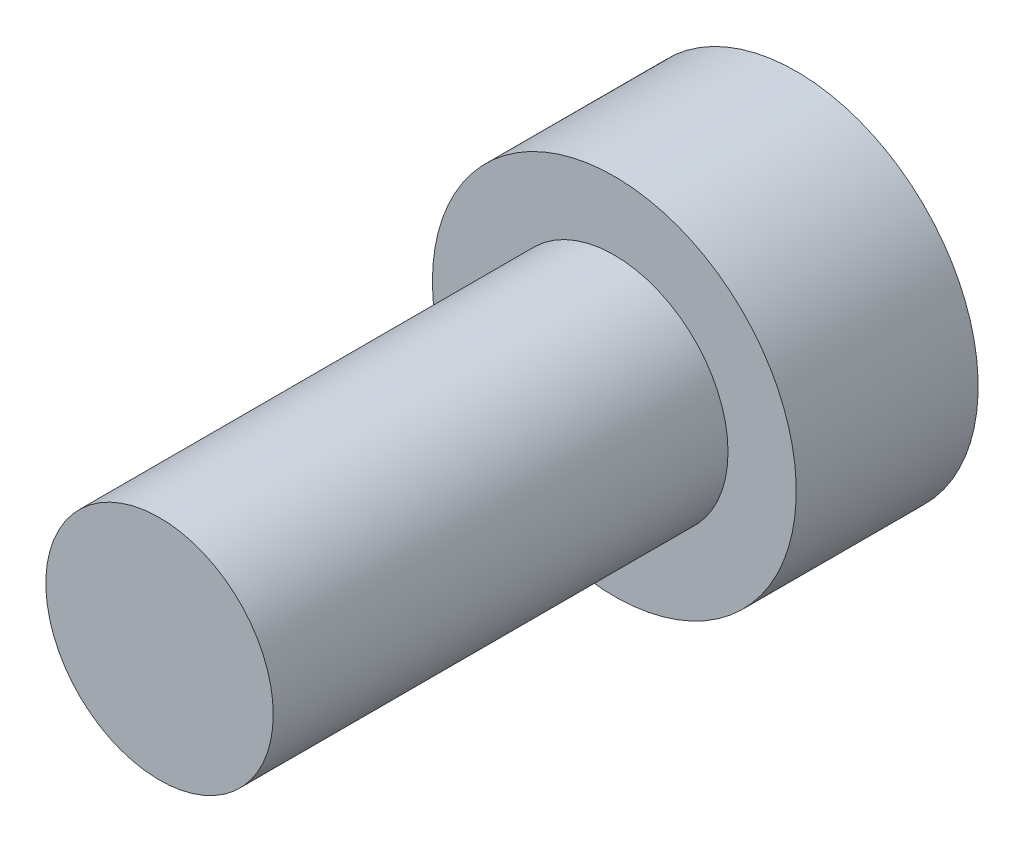
ISO-10303-21;
HEADER;
FILE_DESCRIPTION(('STEP AP214'),'2;1');
FILE_NAME('part.step','',(''),(''),'','','');
FILE_SCHEMA(('AUTOMOTIVE_DESIGN { 1 0 10303 214 1 1 1 1 }'));
ENDSEC;
DATA;
#1=APPLICATION_CONTEXT('core data for automotive mechanical design processes');
#2=APPLICATION_PROTOCOL_DEFINITION('international standard','automotive_design',2000,#1);
#3=PRODUCT_CONTEXT('',#1,'mechanical');
#4=PRODUCT('Part','Part','',(#3));
#5=PRODUCT_RELATED_PRODUCT_CATEGORY('part','',(#4));
#6=PRODUCT_DEFINITION_FORMATION('','',#4);
#7=PRODUCT_DEFINITION_CONTEXT('part definition',#1,'design');
#8=PRODUCT_DEFINITION('design','',#6,#7);
#9=PRODUCT_DEFINITION_SHAPE('','',#8);
#10=(LENGTH_UNIT() NAMED_UNIT(*) SI_UNIT(.MILLI.,.METRE.));
#11=(NAMED_UNIT(*) PLANE_ANGLE_UNIT() SI_UNIT($,.RADIAN.));
#12=(NAMED_UNIT(*) SI_UNIT($,.STERADIAN.) SOLID_ANGLE_UNIT());
#13=UNCERTAINTY_MEASURE_WITH_UNIT(LENGTH_MEASURE(1.E-05),#10,'distance_accuracy_value','');
#14=(GEOMETRIC_REPRESENTATION_CONTEXT(3) GLOBAL_UNCERTAINTY_ASSIGNED_CONTEXT((#13)) GLOBAL_UNIT_ASSIGNED_CONTEXT((#10,
#11,#12)) REPRESENTATION_CONTEXT('',''));
#15=CARTESIAN_POINT('',(0.,0.,0.));
#16=DIRECTION('',(0.,0.,1.));
#17=DIRECTION('',(1.,0.,0.));
#18=AXIS2_PLACEMENT_3D('',#15,#16,#17);
#19=CARTESIAN_POINT('',(0.,0.,10.));
#20=DIRECTION('',(0.,0.,-1.));
#21=DIRECTION('',(-1.,0.,0.));
#22=AXIS2_PLACEMENT_3D('',#19,#20,#21);
#23=CYLINDRICAL_SURFACE('',#22,2.5);
#24=CARTESIAN_POINT('',(0.,0.,10.));
#25=DIRECTION('',(0.,0.,1.));
#26=DIRECTION('',(1.,0.,0.));
#27=AXIS2_PLACEMENT_3D('',#24,#25,#26);
#28=CIRCLE('',#27,2.5);
#29=CARTESIAN_POINT('',(2.5,0.,10.));
#30=VERTEX_POINT('',#29);
#31=EDGE_CURVE('E11',#30,#30,#28,.T.);
#32=ORIENTED_EDGE('',*,*,#31,.F.);
#33=EDGE_LOOP('',(#32));
#34=FACE_BOUND('',#33,.T.);
#35=CARTESIAN_POINT('',(0.,0.,0.));
#36=DIRECTION('',(0.,0.,1.));
#37=DIRECTION('',(1.,0.,0.));
#38=AXIS2_PLACEMENT_3D('',#35,#36,#37);
#39=CIRCLE('',#38,2.5);
#40=CARTESIAN_POINT('',(2.5,0.,0.));
#41=VERTEX_POINT('',#40);
#42=EDGE_CURVE('E50',#41,#41,#39,.T.);
#43=ORIENTED_EDGE('',*,*,#42,.T.);
#44=EDGE_LOOP('',(#43));
#45=FACE_BOUND('',#44,.T.);
#46=ADVANCED_FACE('F47',(#34,#45),#23,.T.);
#47=CARTESIAN_POINT('',(0.,0.,10.));
#48=DIRECTION('',(0.,0.,1.));
#49=DIRECTION('',(1.,0.,0.));
#50=AXIS2_PLACEMENT_3D('',#47,#48,#49);
#51=PLANE('',#50);
#52=ORIENTED_EDGE('',*,*,#31,.T.);
#53=EDGE_LOOP('',(#52));
#54=FACE_BOUND('',#53,.T.);
#55=ADVANCED_FACE('F179',(#54),#51,.T.);
#56=CARTESIAN_POINT('',(0.,0.,-4.));
#57=DIRECTION('',(0.,0.,1.));
#58=DIRECTION('',(1.,0.,0.));
#59=AXIS2_PLACEMENT_3D('',#56,#57,#58);
#60=CYLINDRICAL_SURFACE('',#59,4.);
#61=CARTESIAN_POINT('',(0.,0.,-4.));
#62=DIRECTION('',(0.,0.,-1.));
#63=DIRECTION('',(-1.,0.,0.));
#64=AXIS2_PLACEMENT_3D('',#61,#62,#63);
#65=CIRCLE('',#64,4.);
#66=CARTESIAN_POINT('',(-4.,0.,-4.));
#67=VERTEX_POINT('',#66);
#68=EDGE_CURVE('E154',#67,#67,#65,.T.);
#69=ORIENTED_EDGE('',*,*,#68,.F.);
#70=EDGE_LOOP('',(#69));
#71=FACE_BOUND('',#70,.T.);
#72=CARTESIAN_POINT('',(0.,0.,0.));
#73=DIRECTION('',(0.,0.,-1.));
#74=DIRECTION('',(-1.,0.,0.));
#75=AXIS2_PLACEMENT_3D('',#72,#73,#74);
#76=CIRCLE('',#75,4.);
#77=CARTESIAN_POINT('',(-4.,0.,0.));
#78=VERTEX_POINT('',#77);
#79=EDGE_CURVE('E148',#78,#78,#76,.T.);
#80=ORIENTED_EDGE('',*,*,#79,.T.);
#81=EDGE_LOOP('',(#80));
#82=FACE_BOUND('',#81,.T.);
#83=ADVANCED_FACE('F160',(#71,#82),#60,.T.);
#84=CARTESIAN_POINT('',(0.,0.,-4.));
#85=DIRECTION('',(0.,0.,-1.));
#86=DIRECTION('',(-1.,0.,0.));
#87=AXIS2_PLACEMENT_3D('',#84,#85,#86);
#88=PLANE('',#87);
#89=DIRECTION('',(1.,0.,0.));
#90=VECTOR('',#89,1.);
#91=CARTESIAN_POINT('',(-1.73205080756888,3.,-4.));
#92=LINE('',#91,#90);
#93=CARTESIAN_POINT('',(-1.73205080756888,3.,-4.));
#94=VERTEX_POINT('',#93);
#95=CARTESIAN_POINT('',(1.73205080756888,3.,-4.));
#96=VERTEX_POINT('',#95);
#97=EDGE_CURVE('E61',#94,#96,#92,.T.);
#98=ORIENTED_EDGE('',*,*,#97,.F.);
#99=DIRECTION('',(0.5,0.866025403784439,0.));
#100=VECTOR('',#99,1.);
#101=CARTESIAN_POINT('',(-3.46410161513775,0.,-4.));
#102=LINE('',#101,#100);
#103=CARTESIAN_POINT('',(-3.46410161513775,0.,-4.));
#104=VERTEX_POINT('',#103);
#105=EDGE_CURVE('E144',#104,#94,#102,.T.);
#106=ORIENTED_EDGE('',*,*,#105,.F.);
#107=DIRECTION('',(-0.5,0.866025403784439,0.));
#108=VECTOR('',#107,1.);
#109=CARTESIAN_POINT('',(-1.73205080756888,-3.,-4.));
#110=LINE('',#109,#108);
#111=CARTESIAN_POINT('',(-1.73205080756888,-3.,-4.));
#112=VERTEX_POINT('',#111);
#113=EDGE_CURVE('E142',#112,#104,#110,.T.);
#114=ORIENTED_EDGE('',*,*,#113,.F.);
#115=DIRECTION('',(-1.,0.,0.));
#116=VECTOR('',#115,1.);
#117=CARTESIAN_POINT('',(1.73205080756888,-3.,-4.));
#118=LINE('',#117,#116);
#119=CARTESIAN_POINT('',(1.73205080756888,-3.,-4.));
#120=VERTEX_POINT('',#119);
#121=EDGE_CURVE('E109',#120,#112,#118,.T.);
#122=ORIENTED_EDGE('',*,*,#121,.F.);
#123=DIRECTION('',(-0.5,-0.866025403784439,0.));
#124=VECTOR('',#123,1.);
#125=CARTESIAN_POINT('',(3.46410161513776,0.,-4.));
#126=LINE('',#125,#124);
#127=CARTESIAN_POINT('',(3.46410161513776,0.,-4.));
#128=VERTEX_POINT('',#127);
#129=EDGE_CURVE('E138',#128,#120,#126,.T.);
#130=ORIENTED_EDGE('',*,*,#129,.F.);
#131=DIRECTION('',(0.5,-0.866025403784439,0.));
#132=VECTOR('',#131,1.);
#133=CARTESIAN_POINT('',(1.73205080756888,3.,-4.));
#134=LINE('',#133,#132);
#135=EDGE_CURVE('E135',#96,#128,#134,.T.);
#136=ORIENTED_EDGE('',*,*,#135,.F.);
#137=EDGE_LOOP('',(#98,#106,#114,#122,#130,#136));
#138=FACE_BOUND('',#137,.T.);
#139=ORIENTED_EDGE('',*,*,#68,.T.);
#140=EDGE_LOOP('',(#139));
#141=FACE_BOUND('',#140,.T.);
#142=ADVANCED_FACE('F165',(#138,#141),#88,.T.);
#143=CARTESIAN_POINT('',(0.,0.,0.));
#144=DIRECTION('',(0.,0.,-1.));
#145=DIRECTION('',(-1.,0.,0.));
#146=AXIS2_PLACEMENT_3D('',#143,#144,#145);
#147=PLANE('',#146);
#148=ORIENTED_EDGE('',*,*,#42,.F.);
#149=EDGE_LOOP('',(#148));
#150=FACE_BOUND('',#149,.T.);
#151=ORIENTED_EDGE('',*,*,#79,.F.);
#152=EDGE_LOOP('',(#151));
#153=FACE_BOUND('',#152,.T.);
#154=ADVANCED_FACE('F162',(#150,#153),#147,.F.);
#155=CARTESIAN_POINT('',(-1.73205080756888,3.,-1.));
#156=DIRECTION('',(0.,1.,0.));
#157=DIRECTION('',(0.,0.,1.));
#158=AXIS2_PLACEMENT_3D('',#155,#156,#157);
#159=PLANE('',#158);
#160=ORIENTED_EDGE('',*,*,#97,.T.);
#161=DIRECTION('',(0.,0.,-1.));
#162=VECTOR('',#161,1.);
#163=CARTESIAN_POINT('',(1.73205080756888,3.,-1.));
#164=LINE('',#163,#162);
#165=CARTESIAN_POINT('',(1.73205080756888,3.,-1.));
#166=VERTEX_POINT('',#165);
#167=EDGE_CURVE('E91',#166,#96,#164,.T.);
#168=ORIENTED_EDGE('',*,*,#167,.F.);
#169=DIRECTION('',(1.,0.,0.));
#170=VECTOR('',#169,1.);
#171=CARTESIAN_POINT('',(-1.73205080756888,3.,-1.));
#172=LINE('',#171,#170);
#173=CARTESIAN_POINT('',(-1.73205080756888,3.,-1.));
#174=VERTEX_POINT('',#173);
#175=EDGE_CURVE('E146',#174,#166,#172,.T.);
#176=ORIENTED_EDGE('',*,*,#175,.F.);
#177=DIRECTION('',(0.,0.,-1.));
#178=VECTOR('',#177,1.);
#179=CARTESIAN_POINT('',(-1.73205080756888,3.,-1.));
#180=LINE('',#179,#178);
#181=EDGE_CURVE('E69',#174,#94,#180,.T.);
#182=ORIENTED_EDGE('',*,*,#181,.T.);
#183=EDGE_LOOP('',(#160,#168,#176,#182));
#184=FACE_BOUND('',#183,.T.);
#185=ADVANCED_FACE('F164',(#184),#159,.F.);
#186=CARTESIAN_POINT('',(-3.46410161513775,0.,-1.));
#187=DIRECTION('',(-0.866025403784439,0.5,0.));
#188=DIRECTION('',(-0.5,-0.866025403784439,0.));
#189=AXIS2_PLACEMENT_3D('',#186,#187,#188);
#190=PLANE('',#189);
#191=ORIENTED_EDGE('',*,*,#105,.T.);
#192=ORIENTED_EDGE('',*,*,#181,.F.);
#193=DIRECTION('',(0.5,0.866025403784439,0.));
#194=VECTOR('',#193,1.);
#195=CARTESIAN_POINT('',(-3.46410161513775,0.,-1.));
#196=LINE('',#195,#194);
#197=CARTESIAN_POINT('',(-3.46410161513775,0.,-1.));
#198=VERTEX_POINT('',#197);
#199=EDGE_CURVE('E121',#198,#174,#196,.T.);
#200=ORIENTED_EDGE('',*,*,#199,.F.);
#201=DIRECTION('',(0.,0.,-1.));
#202=VECTOR('',#201,1.);
#203=CARTESIAN_POINT('',(-3.46410161513775,0.,-1.));
#204=LINE('',#203,#202);
#205=EDGE_CURVE('E113',#198,#104,#204,.T.);
#206=ORIENTED_EDGE('',*,*,#205,.T.);
#207=EDGE_LOOP('',(#191,#192,#200,#206));
#208=FACE_BOUND('',#207,.T.);
#209=ADVANCED_FACE('F172',(#208),#190,.F.);
#210=CARTESIAN_POINT('',(-1.73205080756888,-3.,-1.));
#211=DIRECTION('',(-0.866025403784439,-0.5,0.));
#212=DIRECTION('',(0.5,-0.866025403784439,0.));
#213=AXIS2_PLACEMENT_3D('',#210,#211,#212);
#214=PLANE('',#213);
#215=ORIENTED_EDGE('',*,*,#113,.T.);
#216=ORIENTED_EDGE('',*,*,#205,.F.);
#217=DIRECTION('',(-0.5,0.866025403784439,0.));
#218=VECTOR('',#217,1.);
#219=CARTESIAN_POINT('',(-1.73205080756888,-3.,-1.));
#220=LINE('',#219,#218);
#221=CARTESIAN_POINT('',(-1.73205080756888,-3.,-1.));
#222=VERTEX_POINT('',#221);
#223=EDGE_CURVE('E117',#222,#198,#220,.T.);
#224=ORIENTED_EDGE('',*,*,#223,.F.);
#225=DIRECTION('',(0.,0.,-1.));
#226=VECTOR('',#225,1.);
#227=CARTESIAN_POINT('',(-1.73205080756888,-3.,-1.));
#228=LINE('',#227,#226);
#229=EDGE_CURVE('E102',#222,#112,#228,.T.);
#230=ORIENTED_EDGE('',*,*,#229,.T.);
#231=EDGE_LOOP('',(#215,#216,#224,#230));
#232=FACE_BOUND('',#231,.T.);
#233=ADVANCED_FACE('F118',(#232),#214,.F.);
#234=CARTESIAN_POINT('',(1.73205080756888,-3.,-1.));
#235=DIRECTION('',(0.,-1.,0.));
#236=DIRECTION('',(0.,0.,-1.));
#237=AXIS2_PLACEMENT_3D('',#234,#235,#236);
#238=PLANE('',#237);
#239=ORIENTED_EDGE('',*,*,#121,.T.);
#240=ORIENTED_EDGE('',*,*,#229,.F.);
#241=DIRECTION('',(-1.,0.,0.));
#242=VECTOR('',#241,1.);
#243=CARTESIAN_POINT('',(1.73205080756888,-3.,-1.));
#244=LINE('',#243,#242);
#245=CARTESIAN_POINT('',(1.73205080756888,-3.,-1.));
#246=VERTEX_POINT('',#245);
#247=EDGE_CURVE('E106',#246,#222,#244,.T.);
#248=ORIENTED_EDGE('',*,*,#247,.F.);
#249=DIRECTION('',(0.,0.,-1.));
#250=VECTOR('',#249,1.);
#251=CARTESIAN_POINT('',(1.73205080756888,-3.,-1.));
#252=LINE('',#251,#250);
#253=EDGE_CURVE('E114',#246,#120,#252,.T.);
#254=ORIENTED_EDGE('',*,*,#253,.T.);
#255=EDGE_LOOP('',(#239,#240,#248,#254));
#256=FACE_BOUND('',#255,.T.);
#257=ADVANCED_FACE('F104',(#256),#238,.F.);
#258=CARTESIAN_POINT('',(3.46410161513776,0.,-1.));
#259=DIRECTION('',(0.866025403784439,-0.5,0.));
#260=DIRECTION('',(0.5,0.866025403784439,0.));
#261=AXIS2_PLACEMENT_3D('',#258,#259,#260);
#262=PLANE('',#261);
#263=ORIENTED_EDGE('',*,*,#129,.T.);
#264=ORIENTED_EDGE('',*,*,#253,.F.);
#265=DIRECTION('',(-0.5,-0.866025403784439,0.));
#266=VECTOR('',#265,1.);
#267=CARTESIAN_POINT('',(3.46410161513776,0.,-1.));
#268=LINE('',#267,#266);
#269=CARTESIAN_POINT('',(3.46410161513776,0.,-1.));
#270=VERTEX_POINT('',#269);
#271=EDGE_CURVE('E127',#270,#246,#268,.T.);
#272=ORIENTED_EDGE('',*,*,#271,.F.);
#273=DIRECTION('',(0.,0.,-1.));
#274=VECTOR('',#273,1.);
#275=CARTESIAN_POINT('',(3.46410161513776,0.,-1.));
#276=LINE('',#275,#274);
#277=EDGE_CURVE('E151',#270,#128,#276,.T.);
#278=ORIENTED_EDGE('',*,*,#277,.T.);
#279=EDGE_LOOP('',(#263,#264,#272,#278));
#280=FACE_BOUND('',#279,.T.);
#281=ADVANCED_FACE('F238',(#280),#262,.F.);
#282=CARTESIAN_POINT('',(1.73205080756888,3.,-1.));
#283=DIRECTION('',(0.866025403784439,0.5,0.));
#284=DIRECTION('',(-0.5,0.866025403784439,0.));
#285=AXIS2_PLACEMENT_3D('',#282,#283,#284);
#286=PLANE('',#285);
#287=ORIENTED_EDGE('',*,*,#135,.T.);
#288=ORIENTED_EDGE('',*,*,#277,.F.);
#289=DIRECTION('',(0.5,-0.866025403784439,0.));
#290=VECTOR('',#289,1.);
#291=CARTESIAN_POINT('',(1.73205080756888,3.,-1.));
#292=LINE('',#291,#290);
#293=EDGE_CURVE('E129',#166,#270,#292,.T.);
#294=ORIENTED_EDGE('',*,*,#293,.F.);
#295=ORIENTED_EDGE('',*,*,#167,.T.);
#296=EDGE_LOOP('',(#287,#288,#294,#295));
#297=FACE_BOUND('',#296,.T.);
#298=ADVANCED_FACE('F248',(#297),#286,.F.);
#299=CARTESIAN_POINT('',(0.,0.,-1.));
#300=DIRECTION('',(0.,0.,-1.));
#301=DIRECTION('',(-1.,0.,0.));
#302=AXIS2_PLACEMENT_3D('',#299,#300,#301);
#303=PLANE('',#302);
#304=ORIENTED_EDGE('',*,*,#175,.T.);
#305=ORIENTED_EDGE('',*,*,#293,.T.);
#306=ORIENTED_EDGE('',*,*,#271,.T.);
#307=ORIENTED_EDGE('',*,*,#247,.T.);
#308=ORIENTED_EDGE('',*,*,#223,.T.);
#309=ORIENTED_EDGE('',*,*,#199,.T.);
#310=EDGE_LOOP('',(#304,#305,#306,#307,#308,#309));
#311=FACE_BOUND('',#310,.T.);
#312=ADVANCED_FACE('F124',(#311),#303,.T.);
#313=CLOSED_SHELL('',(#46,#55,#83,#142,#154,#185,#209,#233,#257,#281,#298,#312));
#314=MANIFOLD_SOLID_BREP('B2',#313);
#315=ADVANCED_BREP_SHAPE_REPRESENTATION('',(#18,#314),#14);
#316=SHAPE_DEFINITION_REPRESENTATION(#9,#315);
ENDSEC;
END-ISO-10303-21;
